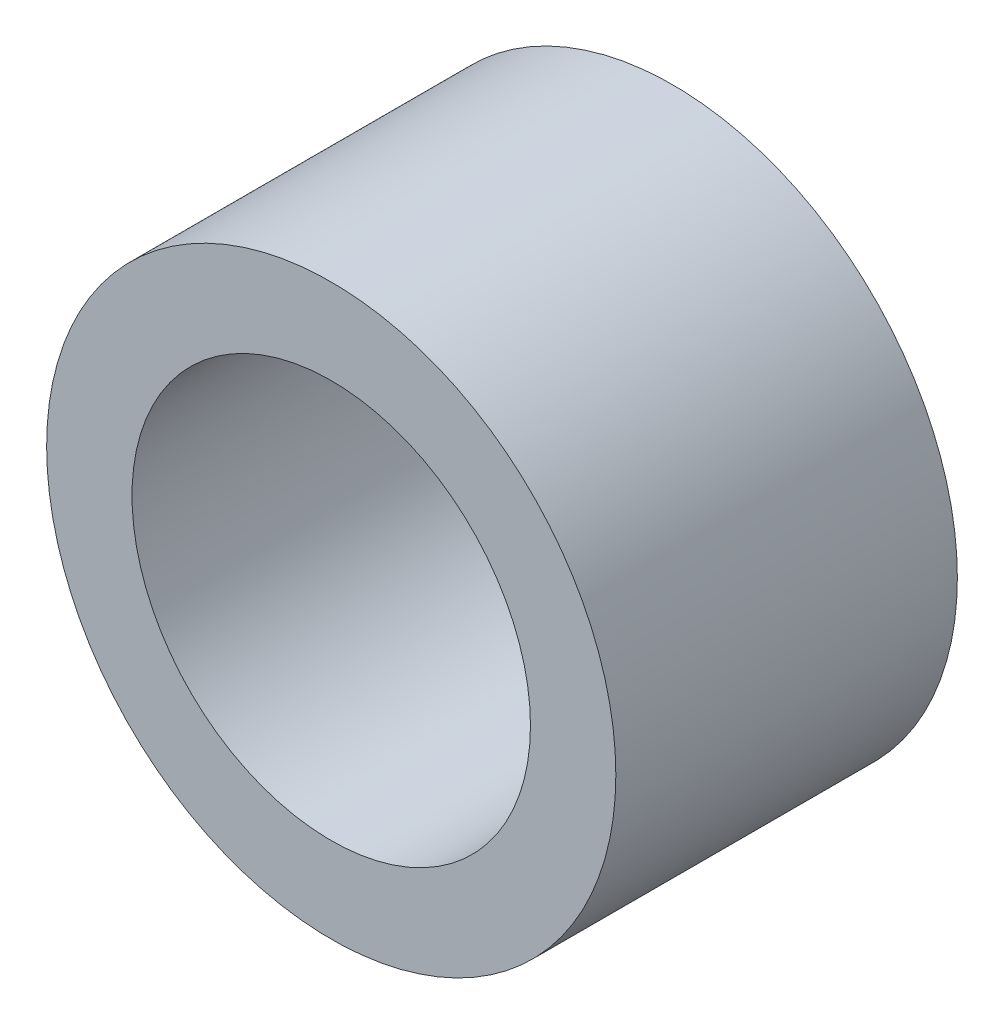
ISO-10303-21;
HEADER;
FILE_DESCRIPTION(('STEP AP214'),'2;1');
FILE_NAME('part.step','',(''),(''),'','','');
FILE_SCHEMA(('AUTOMOTIVE_DESIGN { 1 0 10303 214 1 1 1 1 }'));
ENDSEC;
DATA;
#1=APPLICATION_CONTEXT('core data for automotive mechanical design processes');
#2=APPLICATION_PROTOCOL_DEFINITION('international standard','automotive_design',2000,#1);
#3=PRODUCT_CONTEXT('',#1,'mechanical');
#4=PRODUCT('Part','Part','',(#3));
#5=PRODUCT_RELATED_PRODUCT_CATEGORY('part','',(#4));
#6=PRODUCT_DEFINITION_FORMATION('','',#4);
#7=PRODUCT_DEFINITION_CONTEXT('part definition',#1,'design');
#8=PRODUCT_DEFINITION('design','',#6,#7);
#9=PRODUCT_DEFINITION_SHAPE('','',#8);
#10=(LENGTH_UNIT() NAMED_UNIT(*) SI_UNIT(.MILLI.,.METRE.));
#11=(NAMED_UNIT(*) PLANE_ANGLE_UNIT() SI_UNIT($,.RADIAN.));
#12=(NAMED_UNIT(*) SI_UNIT($,.STERADIAN.) SOLID_ANGLE_UNIT());
#13=UNCERTAINTY_MEASURE_WITH_UNIT(LENGTH_MEASURE(1.E-05),#10,'distance_accuracy_value','');
#14=(GEOMETRIC_REPRESENTATION_CONTEXT(3) GLOBAL_UNCERTAINTY_ASSIGNED_CONTEXT((#13)) GLOBAL_UNIT_ASSIGNED_CONTEXT((#10,
#11,#12)) REPRESENTATION_CONTEXT('',''));
#15=CARTESIAN_POINT('',(0.,0.,0.));
#16=DIRECTION('',(0.,0.,1.));
#17=DIRECTION('',(1.,0.,0.));
#18=AXIS2_PLACEMENT_3D('',#15,#16,#17);
#19=CARTESIAN_POINT('',(0.,0.,3.));
#20=DIRECTION('',(0.,0.,1.));
#21=DIRECTION('',(1.,0.,0.));
#22=AXIS2_PLACEMENT_3D('',#19,#20,#21);
#23=PLANE('',#22);
#24=CARTESIAN_POINT('',(0.,0.,3.));
#25=DIRECTION('',(0.,0.,1.));
#26=DIRECTION('',(1.,0.,0.));
#27=AXIS2_PLACEMENT_3D('',#24,#25,#26);
#28=CIRCLE('',#27,2.5);
#29=CARTESIAN_POINT('',(2.5,0.,3.));
#30=VERTEX_POINT('',#29);
#31=EDGE_CURVE('E10',#30,#30,#28,.T.);
#32=ORIENTED_EDGE('',*,*,#31,.T.);
#33=EDGE_LOOP('',(#32));
#34=FACE_BOUND('',#33,.T.);
#35=CARTESIAN_POINT('',(0.,0.,3.));
#36=DIRECTION('',(0.,0.,1.));
#37=DIRECTION('',(1.,0.,0.));
#38=AXIS2_PLACEMENT_3D('',#35,#36,#37);
#39=CIRCLE('',#38,1.75);
#40=CARTESIAN_POINT('',(1.75,0.,3.));
#41=VERTEX_POINT('',#40);
#42=EDGE_CURVE('E54',#41,#41,#39,.T.);
#43=ORIENTED_EDGE('',*,*,#42,.F.);
#44=EDGE_LOOP('',(#43));
#45=FACE_BOUND('',#44,.T.);
#46=ADVANCED_FACE('F41',(#34,#45),#23,.T.);
#47=CARTESIAN_POINT('',(0.,0.,0.));
#48=DIRECTION('',(0.,0.,1.));
#49=DIRECTION('',(1.,0.,0.));
#50=AXIS2_PLACEMENT_3D('',#47,#48,#49);
#51=PLANE('',#50);
#52=CARTESIAN_POINT('',(0.,0.,0.));
#53=DIRECTION('',(0.,0.,1.));
#54=DIRECTION('',(1.,0.,0.));
#55=AXIS2_PLACEMENT_3D('',#52,#53,#54);
#56=CIRCLE('',#55,2.5);
#57=CARTESIAN_POINT('',(2.5,0.,0.));
#58=VERTEX_POINT('',#57);
#59=EDGE_CURVE('E45',#58,#58,#56,.T.);
#60=ORIENTED_EDGE('',*,*,#59,.F.);
#61=EDGE_LOOP('',(#60));
#62=FACE_BOUND('',#61,.T.);
#63=CARTESIAN_POINT('',(0.,0.,0.));
#64=DIRECTION('',(0.,0.,1.));
#65=DIRECTION('',(1.,0.,0.));
#66=AXIS2_PLACEMENT_3D('',#63,#64,#65);
#67=CIRCLE('',#66,1.75);
#68=CARTESIAN_POINT('',(1.75,0.,0.));
#69=VERTEX_POINT('',#68);
#70=EDGE_CURVE('E56',#69,#69,#67,.T.);
#71=ORIENTED_EDGE('',*,*,#70,.T.);
#72=EDGE_LOOP('',(#71));
#73=FACE_BOUND('',#72,.T.);
#74=ADVANCED_FACE('F68',(#62,#73),#51,.F.);
#75=CARTESIAN_POINT('',(0.,0.,3.));
#76=DIRECTION('',(0.,0.,-1.));
#77=DIRECTION('',(-1.,0.,0.));
#78=AXIS2_PLACEMENT_3D('',#75,#76,#77);
#79=CYLINDRICAL_SURFACE('',#78,2.5);
#80=ORIENTED_EDGE('',*,*,#31,.F.);
#81=EDGE_LOOP('',(#80));
#82=FACE_BOUND('',#81,.T.);
#83=ORIENTED_EDGE('',*,*,#59,.T.);
#84=EDGE_LOOP('',(#83));
#85=FACE_BOUND('',#84,.T.);
#86=ADVANCED_FACE('F43',(#82,#85),#79,.T.);
#87=CARTESIAN_POINT('',(0.,0.,3.));
#88=DIRECTION('',(0.,0.,-1.));
#89=DIRECTION('',(-1.,0.,0.));
#90=AXIS2_PLACEMENT_3D('',#87,#88,#89);
#91=CYLINDRICAL_SURFACE('',#90,1.75);
#92=ORIENTED_EDGE('',*,*,#42,.T.);
#93=EDGE_LOOP('',(#92));
#94=FACE_BOUND('',#93,.T.);
#95=ORIENTED_EDGE('',*,*,#70,.F.);
#96=EDGE_LOOP('',(#95));
#97=FACE_BOUND('',#96,.T.);
#98=ADVANCED_FACE('F64',(#94,#97),#91,.F.);
#99=CLOSED_SHELL('',(#46,#74,#86,#98));
#100=MANIFOLD_SOLID_BREP('B2',#99);
#101=ADVANCED_BREP_SHAPE_REPRESENTATION('',(#18,#100),#14);
#102=SHAPE_DEFINITION_REPRESENTATION(#9,#101);
ENDSEC;
END-ISO-10303-21;
